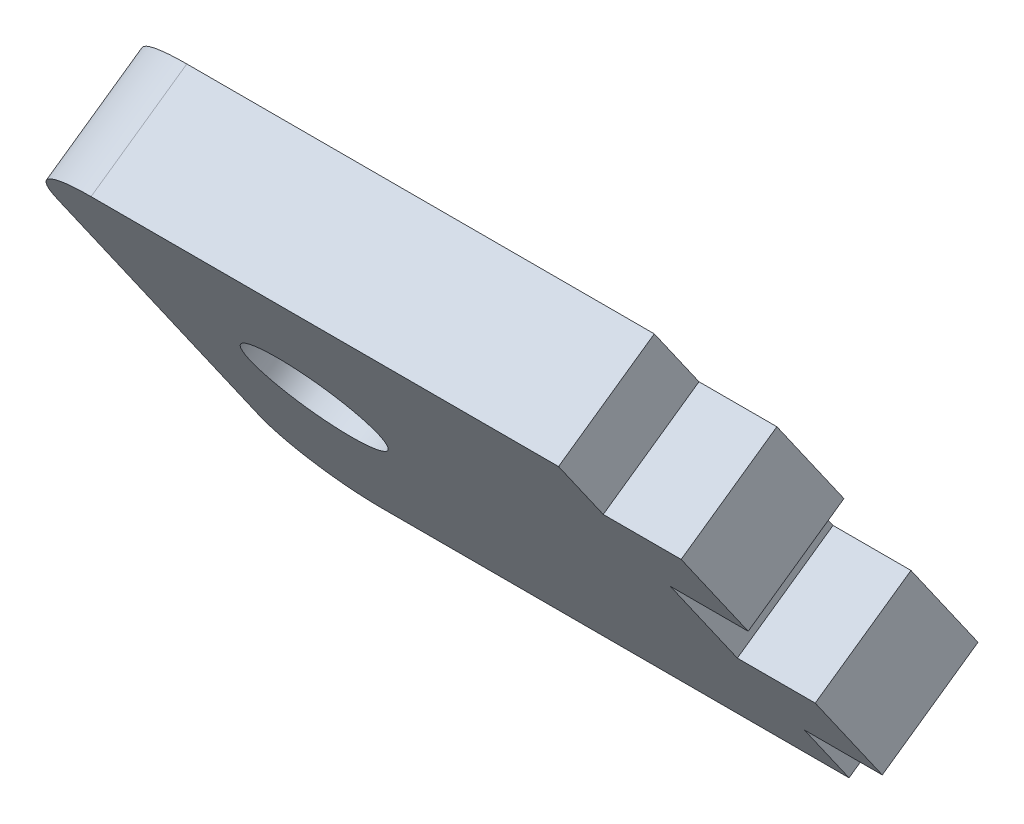
ISO-10303-21;
HEADER;
FILE_DESCRIPTION(('STEP AP214'),'2;1');
FILE_NAME('part.step','',(''),(''),'','','');
FILE_SCHEMA(('AUTOMOTIVE_DESIGN { 1 0 10303 214 1 1 1 1 }'));
ENDSEC;
DATA;
#1=APPLICATION_CONTEXT('core data for automotive mechanical design processes');
#2=APPLICATION_PROTOCOL_DEFINITION('international standard','automotive_design',2000,#1);
#3=PRODUCT_CONTEXT('',#1,'mechanical');
#4=PRODUCT('Part','Part','',(#3));
#5=PRODUCT_RELATED_PRODUCT_CATEGORY('part','',(#4));
#6=PRODUCT_DEFINITION_FORMATION('','',#4);
#7=PRODUCT_DEFINITION_CONTEXT('part definition',#1,'design');
#8=PRODUCT_DEFINITION('design','',#6,#7);
#9=PRODUCT_DEFINITION_SHAPE('','',#8);
#10=(LENGTH_UNIT() NAMED_UNIT(*) SI_UNIT(.MILLI.,.METRE.));
#11=(NAMED_UNIT(*) PLANE_ANGLE_UNIT() SI_UNIT($,.RADIAN.));
#12=(NAMED_UNIT(*) SI_UNIT($,.STERADIAN.) SOLID_ANGLE_UNIT());
#13=UNCERTAINTY_MEASURE_WITH_UNIT(LENGTH_MEASURE(1.E-05),#10,'distance_accuracy_value','');
#14=(GEOMETRIC_REPRESENTATION_CONTEXT(3) GLOBAL_UNCERTAINTY_ASSIGNED_CONTEXT((#13)) GLOBAL_UNIT_ASSIGNED_CONTEXT((#10,
#11,#12)) REPRESENTATION_CONTEXT('',''));
#15=CARTESIAN_POINT('',(0.,0.,0.));
#16=DIRECTION('',(0.,0.,1.));
#17=DIRECTION('',(1.,0.,0.));
#18=AXIS2_PLACEMENT_3D('',#15,#16,#17);
#19=CARTESIAN_POINT('',(653.,-175.181894861384,64.5264330871161));
#20=DIRECTION('',(1.,0.,0.));
#21=DIRECTION('',(0.,0.,-1.));
#22=AXIS2_PLACEMENT_3D('',#19,#20,#21);
#23=PLANE('',#22);
#24=DIRECTION('',(0.,0.819152044288989,0.57357643635105));
#25=VECTOR('',#24,1.);
#26=CARTESIAN_POINT('',(653.,-183.785541406649,76.8137137514509));
#27=LINE('',#26,#25);
#28=CARTESIAN_POINT('',(653.,-216.551623178209,53.8706562974089));
#29=VERTEX_POINT('',#28);
#30=CARTESIAN_POINT('',(653.,-204.264342513874,62.4743028426747));
#31=VERTEX_POINT('',#30);
#32=EDGE_CURVE('E306',#29,#31,#27,.T.);
#33=ORIENTED_EDGE('',*,*,#32,.F.);
#34=CARTESIAN_POINT('',(653.,-216.551623178209,53.8706562974089));
#35=CARTESIAN_POINT('',(653.,-207.947976632943,41.583375633074));
#36=B_SPLINE_CURVE_WITH_KNOTS('',1,(#34,#35),.UNSPECIFIED.,.F.,.F.,(2,2),(0.,0.25),.UNSPECIFIED.);
#37=CARTESIAN_POINT('',(653.,-207.947976632943,41.583375633074));
#38=VERTEX_POINT('',#37);
#39=EDGE_CURVE('E167',#29,#38,#36,.T.);
#40=ORIENTED_EDGE('',*,*,#39,.T.);
#41=DIRECTION('',(0.,0.819152044288989,0.57357643635105));
#42=VECTOR('',#41,1.);
#43=CARTESIAN_POINT('',(653.,-175.181894861384,64.5264330871161));
#44=LINE('',#43,#42);
#45=CARTESIAN_POINT('',(653.,-195.660695968608,50.1870221783398));
#46=VERTEX_POINT('',#45);
#47=EDGE_CURVE('E390',#38,#46,#44,.T.);
#48=ORIENTED_EDGE('',*,*,#47,.T.);
#49=CARTESIAN_POINT('',(653.,-195.660695968608,50.1870221783398));
#50=CARTESIAN_POINT('',(653.,-204.264342513874,62.4743028426747));
#51=B_SPLINE_CURVE_WITH_KNOTS('',1,(#49,#50),.UNSPECIFIED.,.F.,.F.,(2,2),(0.5,0.75),.UNSPECIFIED.);
#52=EDGE_CURVE('E194',#46,#31,#51,.T.);
#53=ORIENTED_EDGE('',*,*,#52,.T.);
#54=EDGE_LOOP('',(#33,#40,#48,#53));
#55=FACE_BOUND('',#54,.T.);
#56=ADVANCED_FACE('F39',(#55),#23,.T.);
#57=CARTESIAN_POINT('',(653.,-228.426777740168,27.2439647242978));
#58=VERTEX_POINT('',#57);
#59=CARTESIAN_POINT('',(653.,-220.235257297278,32.9797290878083));
#60=VERTEX_POINT('',#59);
#61=EDGE_CURVE('E247',#58,#60,#44,.T.);
#62=ORIENTED_EDGE('',*,*,#61,.T.);
#63=CARTESIAN_POINT('',(653.,-220.235257297278,32.9797290878083));
#64=CARTESIAN_POINT('',(653.,-228.838903842544,45.2670097521431));
#65=B_SPLINE_CURVE_WITH_KNOTS('',1,(#63,#64),.UNSPECIFIED.,.F.,.F.,(2,2),(0.5,0.75),.UNSPECIFIED.);
#66=CARTESIAN_POINT('',(653.,-228.838903842544,45.2670097521431));
#67=VERTEX_POINT('',#66);
#68=EDGE_CURVE('E158',#60,#67,#65,.T.);
#69=ORIENTED_EDGE('',*,*,#68,.T.);
#70=CARTESIAN_POINT('',(653.,-237.030424285434,39.5312453886326));
#71=VERTEX_POINT('',#70);
#72=EDGE_CURVE('E303',#71,#67,#27,.T.);
#73=ORIENTED_EDGE('',*,*,#72,.F.);
#74=DIRECTION('',(0.,-0.57357643635105,0.819152044288989));
#75=VECTOR('',#74,1.);
#76=CARTESIAN_POINT('',(653.,-228.426777740168,27.2439647242978));
#77=LINE('',#76,#75);
#78=EDGE_CURVE('E265',#58,#71,#77,.T.);
#79=ORIENTED_EDGE('',*,*,#78,.F.);
#80=EDGE_LOOP('',(#62,#69,#73,#79));
#81=FACE_BOUND('',#80,.T.);
#82=ADVANCED_FACE('F304',(#81),#23,.T.);
#83=CARTESIAN_POINT('',(653.,-191.977061849539,71.0779493879404));
#84=VERTEX_POINT('',#83);
#85=CARTESIAN_POINT('',(653.,-183.785541406649,76.8137137514509));
#86=VERTEX_POINT('',#85);
#87=EDGE_CURVE('E242',#84,#86,#27,.T.);
#88=ORIENTED_EDGE('',*,*,#87,.F.);
#89=CARTESIAN_POINT('',(653.,-191.977061849539,71.0779493879404));
#90=CARTESIAN_POINT('',(653.,-183.373415304273,58.7906687236056));
#91=B_SPLINE_CURVE_WITH_KNOTS('',1,(#89,#90),.UNSPECIFIED.,.F.,.F.,(2,2),(0.,0.25),.UNSPECIFIED.);
#92=CARTESIAN_POINT('',(653.,-183.373415304273,58.7906687236056));
#93=VERTEX_POINT('',#92);
#94=EDGE_CURVE('E193',#84,#93,#91,.T.);
#95=ORIENTED_EDGE('',*,*,#94,.T.);
#96=CARTESIAN_POINT('',(653.,-175.181894861384,64.5264330871161));
#97=VERTEX_POINT('',#96);
#98=EDGE_CURVE('E264',#93,#97,#44,.T.);
#99=ORIENTED_EDGE('',*,*,#98,.T.);
#100=DIRECTION('',(0.,-0.57357643635105,0.819152044288989));
#101=VECTOR('',#100,1.);
#102=CARTESIAN_POINT('',(653.,-175.181894861384,64.5264330871161));
#103=LINE('',#102,#101);
#104=EDGE_CURVE('E269',#97,#86,#103,.T.);
#105=ORIENTED_EDGE('',*,*,#104,.T.);
#106=EDGE_LOOP('',(#88,#95,#99,#105));
#107=FACE_BOUND('',#106,.T.);
#108=ADVANCED_FACE('F319',(#107),#23,.T.);
#109=CARTESIAN_POINT('',(653.,-228.426777740168,27.2439647242978));
#110=DIRECTION('',(0.,-0.819152044288989,-0.57357643635105));
#111=DIRECTION('',(0.,0.57357643635105,-0.819152044288989));
#112=AXIS2_PLACEMENT_3D('',#109,#110,#111);
#113=PLANE('',#112);
#114=DIRECTION('',(1.,0.,0.));
#115=VECTOR('',#114,1.);
#116=CARTESIAN_POINT('',(653.,-237.030424285434,39.5312453886326));
#117=LINE('',#116,#115);
#118=CARTESIAN_POINT('',(593.,-237.030424285434,39.5312453886326));
#119=VERTEX_POINT('',#118);
#120=EDGE_CURVE('E258',#119,#71,#117,.T.);
#121=ORIENTED_EDGE('',*,*,#120,.F.);
#122=DIRECTION('',(0.,-0.57357643635105,0.819152044288989));
#123=VECTOR('',#122,1.);
#124=CARTESIAN_POINT('',(593.,-228.426777740168,27.2439647242978));
#125=LINE('',#124,#123);
#126=CARTESIAN_POINT('',(593.,-228.426777740168,27.2439647242978));
#127=VERTEX_POINT('',#126);
#128=EDGE_CURVE('E62',#119,#127,#125,.F.);
#129=ORIENTED_EDGE('',*,*,#128,.T.);
#130=DIRECTION('',(1.,0.,0.));
#131=VECTOR('',#130,1.);
#132=CARTESIAN_POINT('',(653.,-228.426777740168,27.2439647242978));
#133=LINE('',#132,#131);
#134=EDGE_CURVE('E272',#127,#58,#133,.T.);
#135=ORIENTED_EDGE('',*,*,#134,.T.);
#136=ORIENTED_EDGE('',*,*,#78,.T.);
#137=EDGE_LOOP('',(#121,#129,#135,#136));
#138=FACE_BOUND('',#137,.T.);
#139=ADVANCED_FACE('F299',(#138),#113,.T.);
#140=CARTESIAN_POINT('',(583.,-175.181894861384,64.5264330871161));
#141=DIRECTION('',(-1.,0.,0.));
#142=DIRECTION('',(0.,0.,1.));
#143=AXIS2_PLACEMENT_3D('',#140,#141,#142);
#144=PLANE('',#143);
#145=DIRECTION('',(0.,-0.819152044288989,-0.57357643635105));
#146=VECTOR('',#145,1.);
#147=CARTESIAN_POINT('',(583.,-175.181894861384,64.5264330871161));
#148=LINE('',#147,#146);
#149=CARTESIAN_POINT('',(583.,-183.373415304273,58.7906687236056));
#150=VERTEX_POINT('',#149);
#151=CARTESIAN_POINT('',(583.,-220.235257297278,32.9797290878083));
#152=VERTEX_POINT('',#151);
#153=EDGE_CURVE('E286',#150,#152,#148,.T.);
#154=ORIENTED_EDGE('',*,*,#153,.T.);
#155=DIRECTION('',(0.,-0.57357643635105,0.819152044288989));
#156=VECTOR('',#155,1.);
#157=CARTESIAN_POINT('',(583.,-220.235257297278,32.9797290878083));
#158=LINE('',#157,#156);
#159=CARTESIAN_POINT('',(583.,-228.838903842544,45.2670097521431));
#160=VERTEX_POINT('',#159);
#161=EDGE_CURVE('E274',#152,#160,#158,.T.);
#162=ORIENTED_EDGE('',*,*,#161,.T.);
#163=DIRECTION('',(0.,-0.819152044288989,-0.57357643635105));
#164=VECTOR('',#163,1.);
#165=CARTESIAN_POINT('',(583.,-183.785541406649,76.8137137514509));
#166=LINE('',#165,#164);
#167=CARTESIAN_POINT('',(583.,-191.977061849539,71.0779493879404));
#168=VERTEX_POINT('',#167);
#169=EDGE_CURVE('E254',#168,#160,#166,.T.);
#170=ORIENTED_EDGE('',*,*,#169,.F.);
#171=DIRECTION('',(0.,-0.57357643635105,0.819152044288989));
#172=VECTOR('',#171,1.);
#173=CARTESIAN_POINT('',(583.,-183.373415304273,58.7906687236056));
#174=LINE('',#173,#172);
#175=EDGE_CURVE('E268',#168,#150,#174,.F.);
#176=ORIENTED_EDGE('',*,*,#175,.T.);
#177=EDGE_LOOP('',(#154,#162,#170,#176));
#178=FACE_BOUND('',#177,.T.);
#179=ADVANCED_FACE('F290',(#178),#144,.T.);
#180=CARTESIAN_POINT('',(653.,-175.181894861384,64.5264330871161));
#181=DIRECTION('',(0.,0.819152044288989,0.57357643635105));
#182=DIRECTION('',(0.,-0.57357643635105,0.819152044288989));
#183=AXIS2_PLACEMENT_3D('',#180,#181,#182);
#184=PLANE('',#183);
#185=DIRECTION('',(-1.,0.,0.));
#186=VECTOR('',#185,1.);
#187=CARTESIAN_POINT('',(653.,-175.181894861384,64.5264330871161));
#188=LINE('',#187,#186);
#189=CARTESIAN_POINT('',(593.,-175.181894861384,64.5264330871161));
#190=VERTEX_POINT('',#189);
#191=EDGE_CURVE('E293',#97,#190,#188,.T.);
#192=ORIENTED_EDGE('',*,*,#191,.T.);
#193=DIRECTION('',(0.,-0.57357643635105,0.819152044288989));
#194=VECTOR('',#193,1.);
#195=CARTESIAN_POINT('',(593.,-175.181894861384,64.5264330871161));
#196=LINE('',#195,#194);
#197=CARTESIAN_POINT('',(593.,-183.785541406649,76.8137137514509));
#198=VERTEX_POINT('',#197);
#199=EDGE_CURVE('E12',#190,#198,#196,.T.);
#200=ORIENTED_EDGE('',*,*,#199,.T.);
#201=DIRECTION('',(-1.,0.,0.));
#202=VECTOR('',#201,1.);
#203=CARTESIAN_POINT('',(653.,-183.785541406649,76.8137137514509));
#204=LINE('',#203,#202);
#205=EDGE_CURVE('E259',#86,#198,#204,.T.);
#206=ORIENTED_EDGE('',*,*,#205,.F.);
#207=ORIENTED_EDGE('',*,*,#104,.F.);
#208=EDGE_LOOP('',(#192,#200,#206,#207));
#209=FACE_BOUND('',#208,.T.);
#210=ADVANCED_FACE('F322',(#209),#184,.T.);
#211=CARTESIAN_POINT('',(0.,-87.9505855452157,125.6064534382));
#212=DIRECTION('',(0.,0.57357643635105,-0.819152044288989));
#213=DIRECTION('',(0.,0.819152044288989,0.57357643635105));
#214=AXIS2_PLACEMENT_3D('',#211,#212,#213);
#215=PLANE('',#214);
#216=CARTESIAN_POINT('',(603.,-201.804336300776,45.8851989057069));
#217=DIRECTION('',(0.,-0.57357643635105,0.819152044288989));
#218=DIRECTION('',(0.,-0.819152044288989,-0.57357643635105));
#219=AXIS2_PLACEMENT_3D('',#216,#217,#218);
#220=CIRCLE('',#219,8.25000000000012);
#221=CARTESIAN_POINT('',(603.,-208.56234066616,41.1531933058107));
#222=VERTEX_POINT('',#221);
#223=EDGE_CURVE('E239',#222,#222,#220,.T.);
#224=ORIENTED_EDGE('',*,*,#223,.T.);
#225=EDGE_LOOP('',(#224));
#226=FACE_BOUND('',#225,.T.);
#227=ORIENTED_EDGE('',*,*,#134,.F.);
#228=CARTESIAN_POINT('',(593.,-220.235257297278,32.9797290878083));
#229=DIRECTION('',(0.,0.57357643635105,-0.819152044288989));
#230=DIRECTION('',(0.,0.819152044288989,0.57357643635105));
#231=AXIS2_PLACEMENT_3D('',#228,#229,#230);
#232=CIRCLE('',#231,10.);
#233=EDGE_CURVE('E47',#127,#152,#232,.T.);
#234=ORIENTED_EDGE('',*,*,#233,.T.);
#235=ORIENTED_EDGE('',*,*,#153,.F.);
#236=CARTESIAN_POINT('',(593.,-183.373415304273,58.7906687236056));
#237=DIRECTION('',(0.,0.57357643635105,-0.819152044288989));
#238=DIRECTION('',(0.,0.819152044288989,0.57357643635105));
#239=AXIS2_PLACEMENT_3D('',#236,#237,#238);
#240=CIRCLE('',#239,10.);
#241=EDGE_CURVE('E54',#150,#190,#240,.T.);
#242=ORIENTED_EDGE('',*,*,#241,.T.);
#243=ORIENTED_EDGE('',*,*,#191,.F.);
#244=ORIENTED_EDGE('',*,*,#98,.F.);
#245=DIRECTION('',(-1.,0.,0.));
#246=VECTOR('',#245,1.);
#247=CARTESIAN_POINT('',(673.,-183.373415304273,58.7906687236056));
#248=LINE('',#247,#246);
#249=CARTESIAN_POINT('',(663.,-183.373415304273,58.7906687236056));
#250=VERTEX_POINT('',#249);
#251=EDGE_CURVE('E216',#250,#93,#248,.T.);
#252=ORIENTED_EDGE('',*,*,#251,.F.);
#253=DIRECTION('',(0.,-0.819152044288989,-0.57357643635105));
#254=VECTOR('',#253,1.);
#255=CARTESIAN_POINT('',(663.,-183.373415304273,58.7906687236056));
#256=LINE('',#255,#254);
#257=CARTESIAN_POINT('',(663.,-195.660695968608,50.1870221783398));
#258=VERTEX_POINT('',#257);
#259=EDGE_CURVE('E199',#250,#258,#256,.T.);
#260=ORIENTED_EDGE('',*,*,#259,.T.);
#261=DIRECTION('',(-1.,0.,0.));
#262=VECTOR('',#261,1.);
#263=CARTESIAN_POINT('',(673.,-195.660695968608,50.1870221783398));
#264=LINE('',#263,#262);
#265=EDGE_CURVE('E212',#258,#46,#264,.T.);
#266=ORIENTED_EDGE('',*,*,#265,.T.);
#267=ORIENTED_EDGE('',*,*,#47,.F.);
#268=DIRECTION('',(-1.,0.,0.));
#269=VECTOR('',#268,1.);
#270=CARTESIAN_POINT('',(673.,-207.947976632943,41.583375633074));
#271=LINE('',#270,#269);
#272=CARTESIAN_POINT('',(663.,-207.947976632943,41.583375633074));
#273=VERTEX_POINT('',#272);
#274=EDGE_CURVE('E165',#273,#38,#271,.T.);
#275=ORIENTED_EDGE('',*,*,#274,.F.);
#276=DIRECTION('',(0.,-0.819152044288989,-0.57357643635105));
#277=VECTOR('',#276,1.);
#278=CARTESIAN_POINT('',(663.,-207.947976632943,41.583375633074));
#279=LINE('',#278,#277);
#280=CARTESIAN_POINT('',(663.,-220.235257297278,32.9797290878083));
#281=VERTEX_POINT('',#280);
#282=EDGE_CURVE('E146',#273,#281,#279,.T.);
#283=ORIENTED_EDGE('',*,*,#282,.T.);
#284=DIRECTION('',(-1.,0.,0.));
#285=VECTOR('',#284,1.);
#286=CARTESIAN_POINT('',(673.,-220.235257297278,32.9797290878083));
#287=LINE('',#286,#285);
#288=EDGE_CURVE('E153',#281,#60,#287,.T.);
#289=ORIENTED_EDGE('',*,*,#288,.T.);
#290=ORIENTED_EDGE('',*,*,#61,.F.);
#291=EDGE_LOOP('',(#227,#234,#235,#242,#243,#244,#252,#260,#266,#267,#275,#283,#289,#290));
#292=FACE_BOUND('',#291,.T.);
#293=ADVANCED_FACE('F163',(#226,#292),#215,.T.);
#294=CARTESIAN_POINT('',(0.,-96.5542320904814,137.893734102535));
#295=DIRECTION('',(0.,0.57357643635105,-0.819152044288989));
#296=DIRECTION('',(0.,0.819152044288989,0.57357643635105));
#297=AXIS2_PLACEMENT_3D('',#294,#295,#296);
#298=PLANE('',#297);
#299=CARTESIAN_POINT('',(603.,-210.407982846041,58.1724795700418));
#300=DIRECTION('',(0.,-0.57357643635105,0.819152044288989));
#301=DIRECTION('',(0.,-0.819152044288989,-0.57357643635105));
#302=AXIS2_PLACEMENT_3D('',#299,#300,#301);
#303=CIRCLE('',#302,8.25000000000012);
#304=CARTESIAN_POINT('',(603.,-217.165987211426,53.4404739701455));
#305=VERTEX_POINT('',#304);
#306=EDGE_CURVE('E238',#305,#305,#303,.T.);
#307=ORIENTED_EDGE('',*,*,#306,.F.);
#308=EDGE_LOOP('',(#307));
#309=FACE_BOUND('',#308,.T.);
#310=ORIENTED_EDGE('',*,*,#169,.T.);
#311=CARTESIAN_POINT('',(593.,-228.838903842544,45.2670097521432));
#312=DIRECTION('',(0.,0.57357643635105,-0.819152044288989));
#313=DIRECTION('',(0.,0.819152044288989,0.57357643635105));
#314=AXIS2_PLACEMENT_3D('',#311,#312,#313);
#315=CIRCLE('',#314,10.);
#316=EDGE_CURVE('E280',#160,#119,#315,.F.);
#317=ORIENTED_EDGE('',*,*,#316,.T.);
#318=ORIENTED_EDGE('',*,*,#120,.T.);
#319=ORIENTED_EDGE('',*,*,#72,.T.);
#320=DIRECTION('',(-1.,0.,0.));
#321=VECTOR('',#320,1.);
#322=CARTESIAN_POINT('',(673.,-228.838903842544,45.2670097521431));
#323=LINE('',#322,#321);
#324=CARTESIAN_POINT('',(663.,-228.838903842544,45.2670097521431));
#325=VERTEX_POINT('',#324);
#326=EDGE_CURVE('E152',#325,#67,#323,.T.);
#327=ORIENTED_EDGE('',*,*,#326,.F.);
#328=DIRECTION('',(0.,0.819152044288989,0.57357643635105));
#329=VECTOR('',#328,1.);
#330=CARTESIAN_POINT('',(663.,-228.838903842544,45.2670097521431));
#331=LINE('',#330,#329);
#332=CARTESIAN_POINT('',(663.,-216.551623178209,53.8706562974089));
#333=VERTEX_POINT('',#332);
#334=EDGE_CURVE('E149',#325,#333,#331,.T.);
#335=ORIENTED_EDGE('',*,*,#334,.T.);
#336=DIRECTION('',(-1.,0.,0.));
#337=VECTOR('',#336,1.);
#338=CARTESIAN_POINT('',(673.,-216.551623178209,53.8706562974089));
#339=LINE('',#338,#337);
#340=EDGE_CURVE('E175',#333,#29,#339,.T.);
#341=ORIENTED_EDGE('',*,*,#340,.T.);
#342=ORIENTED_EDGE('',*,*,#32,.T.);
#343=DIRECTION('',(-1.,0.,0.));
#344=VECTOR('',#343,1.);
#345=CARTESIAN_POINT('',(673.,-204.264342513874,62.4743028426747));
#346=LINE('',#345,#344);
#347=CARTESIAN_POINT('',(663.,-204.264342513874,62.4743028426747));
#348=VERTEX_POINT('',#347);
#349=EDGE_CURVE('E223',#348,#31,#346,.T.);
#350=ORIENTED_EDGE('',*,*,#349,.F.);
#351=DIRECTION('',(0.,0.819152044288989,0.57357643635105));
#352=VECTOR('',#351,1.);
#353=CARTESIAN_POINT('',(663.,-204.264342513874,62.4743028426747));
#354=LINE('',#353,#352);
#355=CARTESIAN_POINT('',(663.,-191.977061849539,71.0779493879404));
#356=VERTEX_POINT('',#355);
#357=EDGE_CURVE('E218',#348,#356,#354,.T.);
#358=ORIENTED_EDGE('',*,*,#357,.T.);
#359=DIRECTION('',(-1.,0.,0.));
#360=VECTOR('',#359,1.);
#361=CARTESIAN_POINT('',(673.,-191.977061849539,71.0779493879404));
#362=LINE('',#361,#360);
#363=EDGE_CURVE('E217',#356,#84,#362,.T.);
#364=ORIENTED_EDGE('',*,*,#363,.T.);
#365=ORIENTED_EDGE('',*,*,#87,.T.);
#366=ORIENTED_EDGE('',*,*,#205,.T.);
#367=CARTESIAN_POINT('',(593.,-191.977061849539,71.0779493879404));
#368=DIRECTION('',(0.,0.57357643635105,-0.819152044288989));
#369=DIRECTION('',(0.,0.819152044288989,0.57357643635105));
#370=AXIS2_PLACEMENT_3D('',#367,#368,#369);
#371=CIRCLE('',#370,10.);
#372=EDGE_CURVE('E277',#198,#168,#371,.F.);
#373=ORIENTED_EDGE('',*,*,#372,.T.);
#374=EDGE_LOOP('',(#310,#317,#318,#319,#327,#335,#341,#342,#350,#358,#364,#365,#366,#373));
#375=FACE_BOUND('',#374,.T.);
#376=ADVANCED_FACE('F297',(#309,#375),#298,.F.);
#377=CARTESIAN_POINT('',(603.,-201.804336300776,45.8851989057069));
#378=DIRECTION('',(0.,-0.57357643635105,0.819152044288989));
#379=DIRECTION('',(0.,-0.819152044288989,-0.57357643635105));
#380=AXIS2_PLACEMENT_3D('',#377,#378,#379);
#381=CYLINDRICAL_SURFACE('',#380,8.25000000000012);
#382=ORIENTED_EDGE('',*,*,#223,.F.);
#383=EDGE_LOOP('',(#382));
#384=FACE_BOUND('',#383,.T.);
#385=ORIENTED_EDGE('',*,*,#306,.T.);
#386=EDGE_LOOP('',(#385));
#387=FACE_BOUND('',#386,.T.);
#388=ADVANCED_FACE('F357',(#384,#387),#381,.F.);
#389=CARTESIAN_POINT('',(663.,0.,0.));
#390=DIRECTION('',(1.,0.,0.));
#391=DIRECTION('',(0.,0.,-1.));
#392=AXIS2_PLACEMENT_3D('',#389,#390,#391);
#393=PLANE('',#392);
#394=DIRECTION('',(0.,0.57357643635105,-0.819152044288989));
#395=VECTOR('',#394,1.);
#396=CARTESIAN_POINT('',(663.,-191.977061849539,71.0779493879404));
#397=LINE('',#396,#395);
#398=EDGE_CURVE('E213',#356,#250,#397,.T.);
#399=ORIENTED_EDGE('',*,*,#398,.F.);
#400=ORIENTED_EDGE('',*,*,#357,.F.);
#401=DIRECTION('',(0.,-0.57357643635105,0.819152044288989));
#402=VECTOR('',#401,1.);
#403=CARTESIAN_POINT('',(663.,-195.660695968608,50.1870221783398));
#404=LINE('',#403,#402);
#405=EDGE_CURVE('E224',#258,#348,#404,.T.);
#406=ORIENTED_EDGE('',*,*,#405,.F.);
#407=ORIENTED_EDGE('',*,*,#259,.F.);
#408=EDGE_LOOP('',(#399,#400,#406,#407));
#409=FACE_BOUND('',#408,.T.);
#410=ADVANCED_FACE('F362',(#409),#393,.T.);
#411=CARTESIAN_POINT('',(673.,-195.660695968608,50.1870221783398));
#412=DIRECTION('',(0.,-0.819152044288989,-0.57357643635105));
#413=DIRECTION('',(0.,0.57357643635105,-0.819152044288989));
#414=AXIS2_PLACEMENT_3D('',#411,#412,#413);
#415=PLANE('',#414);
#416=ORIENTED_EDGE('',*,*,#265,.F.);
#417=ORIENTED_EDGE('',*,*,#405,.T.);
#418=ORIENTED_EDGE('',*,*,#349,.T.);
#419=ORIENTED_EDGE('',*,*,#52,.F.);
#420=EDGE_LOOP('',(#416,#417,#418,#419));
#421=FACE_BOUND('',#420,.T.);
#422=ADVANCED_FACE('F366',(#421),#415,.T.);
#423=CARTESIAN_POINT('',(673.,-191.977061849539,71.0779493879404));
#424=DIRECTION('',(0.,0.819152044288989,0.57357643635105));
#425=DIRECTION('',(0.,-0.57357643635105,0.819152044288989));
#426=AXIS2_PLACEMENT_3D('',#423,#424,#425);
#427=PLANE('',#426);
#428=ORIENTED_EDGE('',*,*,#363,.F.);
#429=ORIENTED_EDGE('',*,*,#398,.T.);
#430=ORIENTED_EDGE('',*,*,#251,.T.);
#431=ORIENTED_EDGE('',*,*,#94,.F.);
#432=EDGE_LOOP('',(#428,#429,#430,#431));
#433=FACE_BOUND('',#432,.T.);
#434=ADVANCED_FACE('F370',(#433),#427,.T.);
#435=CARTESIAN_POINT('',(663.,0.,0.));
#436=DIRECTION('',(1.,0.,0.));
#437=DIRECTION('',(0.,0.,-1.));
#438=AXIS2_PLACEMENT_3D('',#435,#436,#437);
#439=PLANE('',#438);
#440=DIRECTION('',(0.,0.57357643635105,-0.819152044288989));
#441=VECTOR('',#440,1.);
#442=CARTESIAN_POINT('',(663.,-216.551623178209,53.8706562974089));
#443=LINE('',#442,#441);
#444=EDGE_CURVE('E173',#333,#273,#443,.T.);
#445=ORIENTED_EDGE('',*,*,#444,.F.);
#446=ORIENTED_EDGE('',*,*,#334,.F.);
#447=DIRECTION('',(0.,-0.57357643635105,0.819152044288989));
#448=VECTOR('',#447,1.);
#449=CARTESIAN_POINT('',(663.,-220.235257297278,32.9797290878083));
#450=LINE('',#449,#448);
#451=EDGE_CURVE('E142',#281,#325,#450,.T.);
#452=ORIENTED_EDGE('',*,*,#451,.F.);
#453=ORIENTED_EDGE('',*,*,#282,.F.);
#454=EDGE_LOOP('',(#445,#446,#452,#453));
#455=FACE_BOUND('',#454,.T.);
#456=ADVANCED_FACE('F144',(#455),#439,.T.);
#457=CARTESIAN_POINT('',(673.,-220.235257297278,32.9797290878083));
#458=DIRECTION('',(0.,-0.819152044288989,-0.57357643635105));
#459=DIRECTION('',(0.,0.57357643635105,-0.819152044288989));
#460=AXIS2_PLACEMENT_3D('',#457,#458,#459);
#461=PLANE('',#460);
#462=ORIENTED_EDGE('',*,*,#288,.F.);
#463=ORIENTED_EDGE('',*,*,#451,.T.);
#464=ORIENTED_EDGE('',*,*,#326,.T.);
#465=ORIENTED_EDGE('',*,*,#68,.F.);
#466=EDGE_LOOP('',(#462,#463,#464,#465));
#467=FACE_BOUND('',#466,.T.);
#468=ADVANCED_FACE('F156',(#467),#461,.T.);
#469=CARTESIAN_POINT('',(673.,-216.551623178209,53.8706562974089));
#470=DIRECTION('',(0.,0.819152044288989,0.57357643635105));
#471=DIRECTION('',(0.,-0.57357643635105,0.819152044288989));
#472=AXIS2_PLACEMENT_3D('',#469,#470,#471);
#473=PLANE('',#472);
#474=ORIENTED_EDGE('',*,*,#340,.F.);
#475=ORIENTED_EDGE('',*,*,#444,.T.);
#476=ORIENTED_EDGE('',*,*,#274,.T.);
#477=ORIENTED_EDGE('',*,*,#39,.F.);
#478=EDGE_LOOP('',(#474,#475,#476,#477));
#479=FACE_BOUND('',#478,.T.);
#480=ADVANCED_FACE('F329',(#479),#473,.T.);
#481=CARTESIAN_POINT('',(593.,-220.235257297278,32.9797290878083));
#482=DIRECTION('',(0.,-0.57357643635105,0.819152044288989));
#483=DIRECTION('',(0.,-0.819152044288989,-0.57357643635105));
#484=AXIS2_PLACEMENT_3D('',#481,#482,#483);
#485=CYLINDRICAL_SURFACE('',#484,10.);
#486=ORIENTED_EDGE('',*,*,#233,.F.);
#487=ORIENTED_EDGE('',*,*,#128,.F.);
#488=ORIENTED_EDGE('',*,*,#316,.F.);
#489=ORIENTED_EDGE('',*,*,#161,.F.);
#490=EDGE_LOOP('',(#486,#487,#488,#489));
#491=FACE_BOUND('',#490,.T.);
#492=ADVANCED_FACE('F295',(#491),#485,.T.);
#493=CARTESIAN_POINT('',(593.,-183.373415304273,58.7906687236056));
#494=DIRECTION('',(0.,-0.57357643635105,0.819152044288989));
#495=DIRECTION('',(0.,-0.819152044288989,-0.57357643635105));
#496=AXIS2_PLACEMENT_3D('',#493,#494,#495);
#497=CYLINDRICAL_SURFACE('',#496,10.);
#498=ORIENTED_EDGE('',*,*,#241,.F.);
#499=ORIENTED_EDGE('',*,*,#175,.F.);
#500=ORIENTED_EDGE('',*,*,#372,.F.);
#501=ORIENTED_EDGE('',*,*,#199,.F.);
#502=EDGE_LOOP('',(#498,#499,#500,#501));
#503=FACE_BOUND('',#502,.T.);
#504=ADVANCED_FACE('F41',(#503),#497,.T.);
#505=CLOSED_SHELL('',(#56,#82,#108,#139,#179,#210,#293,#376,#388,#410,#422,#434,#456,#468,#480,
#492,#504));
#506=MANIFOLD_SOLID_BREP('B2',#505);
#507=ADVANCED_BREP_SHAPE_REPRESENTATION('',(#18,#506),#14);
#508=SHAPE_DEFINITION_REPRESENTATION(#9,#507);
ENDSEC;
END-ISO-10303-21;
